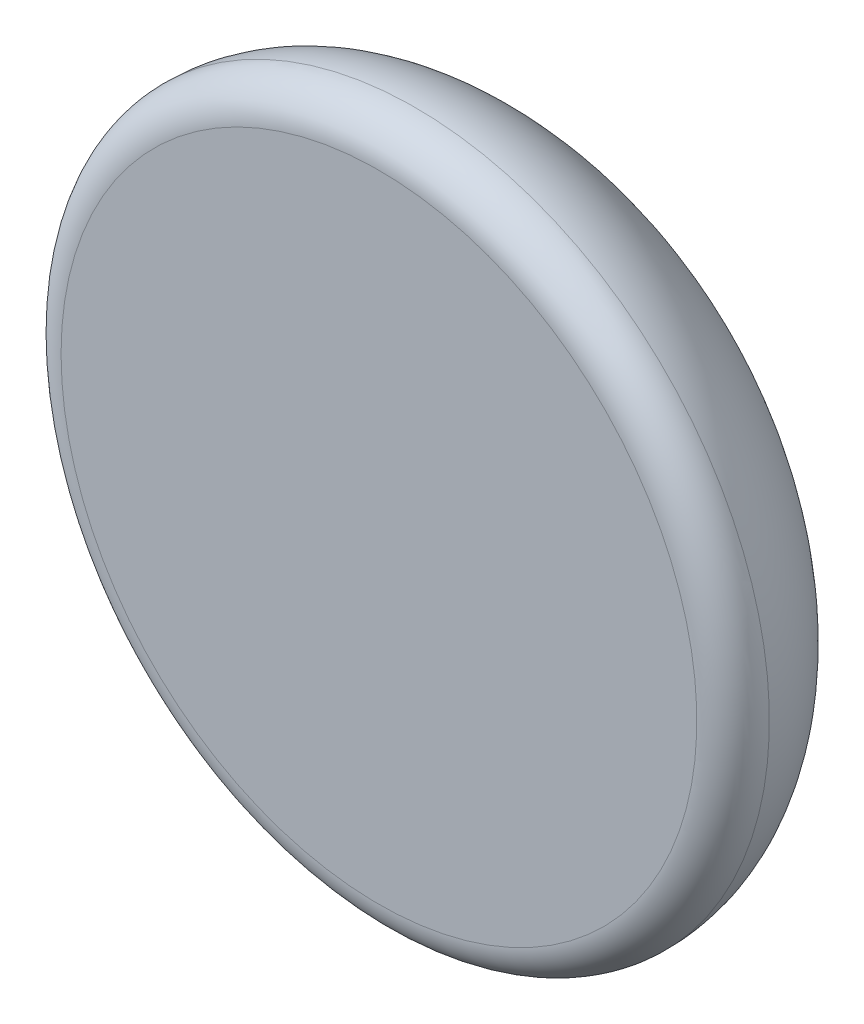
ISO-10303-21;
HEADER;
FILE_DESCRIPTION(('STEP AP214'),'2;1');
FILE_NAME('part.step','',(''),(''),'','','');
FILE_SCHEMA(('AUTOMOTIVE_DESIGN { 1 0 10303 214 1 1 1 1 }'));
ENDSEC;
DATA;
#1=APPLICATION_CONTEXT('core data for automotive mechanical design processes');
#2=APPLICATION_PROTOCOL_DEFINITION('international standard','automotive_design',2000,#1);
#3=PRODUCT_CONTEXT('',#1,'mechanical');
#4=PRODUCT('Part','Part','',(#3));
#5=PRODUCT_RELATED_PRODUCT_CATEGORY('part','',(#4));
#6=PRODUCT_DEFINITION_FORMATION('','',#4);
#7=PRODUCT_DEFINITION_CONTEXT('part definition',#1,'design');
#8=PRODUCT_DEFINITION('design','',#6,#7);
#9=PRODUCT_DEFINITION_SHAPE('','',#8);
#10=(LENGTH_UNIT() NAMED_UNIT(*) SI_UNIT(.MILLI.,.METRE.));
#11=(NAMED_UNIT(*) PLANE_ANGLE_UNIT() SI_UNIT($,.RADIAN.));
#12=(NAMED_UNIT(*) SI_UNIT($,.STERADIAN.) SOLID_ANGLE_UNIT());
#13=UNCERTAINTY_MEASURE_WITH_UNIT(LENGTH_MEASURE(1.E-05),#10,'distance_accuracy_value','');
#14=(GEOMETRIC_REPRESENTATION_CONTEXT(3) GLOBAL_UNCERTAINTY_ASSIGNED_CONTEXT((#13)) GLOBAL_UNIT_ASSIGNED_CONTEXT((#10,
#11,#12)) REPRESENTATION_CONTEXT('',''));
#15=CARTESIAN_POINT('',(0.,0.,0.));
#16=DIRECTION('',(0.,0.,1.));
#17=DIRECTION('',(1.,0.,0.));
#18=AXIS2_PLACEMENT_3D('',#15,#16,#17);
#19=CARTESIAN_POINT('',(0.,0.,0.));
#20=DIRECTION('',(0.,1.,0.));
#21=DIRECTION('',(-1.,0.,0.));
#22=AXIS2_PLACEMENT_3D('',#19,#20,#21);
#23=ELLIPSE('',#22,62.,33.65);
#24=TRIMMED_CURVE('',#23,(PARAMETER_VALUE(4.71238898038469)),
(PARAMETER_VALUE(7.85398163397448)),.T.,.PARAMETER.);
#25=CARTESIAN_POINT('',(0.,0.,-33.65));
#26=DIRECTION('',(0.,0.,-1.));
#27=AXIS1_PLACEMENT('',#25,#26);
#28=SURFACE_OF_REVOLUTION('',#24,#27);
#29=CARTESIAN_POINT('',(0.,0.,0.));
#30=DIRECTION('',(0.,0.,-1.));
#31=DIRECTION('',(-1.,0.,0.));
#32=AXIS2_PLACEMENT_3D('',#29,#30,#31);
#33=CIRCLE('',#32,62.);
#34=CARTESIAN_POINT('',(-62.,0.,0.));
#35=VERTEX_POINT('',#34);
#36=EDGE_CURVE('E11',#35,#35,#33,.T.);
#37=ORIENTED_EDGE('',*,*,#36,.T.);
#38=EDGE_LOOP('',(#37));
#39=FACE_BOUND('',#38,.T.);
#40=CARTESIAN_POINT('',(0.,0.,-33.65));
#41=VERTEX_POINT('',#40);
#42=VERTEX_LOOP('',#41);
#43=FACE_BOUND('',#42,.T.);
#44=ADVANCED_FACE('F33',(#39,#43),#28,.F.);
#45=CARTESIAN_POINT('',(0.,0.,0.));
#46=DIRECTION('',(0.,0.,-1.));
#47=DIRECTION('',(-1.,0.,0.));
#48=AXIS2_PLACEMENT_3D('',#45,#46,#47);
#49=TOROIDAL_SURFACE('',#48,55.65,6.35);
#50=CARTESIAN_POINT('',(0.,0.,6.35000000000001));
#51=DIRECTION('',(0.,0.,-1.));
#52=DIRECTION('',(-1.,0.,0.));
#53=AXIS2_PLACEMENT_3D('',#50,#51,#52);
#54=CIRCLE('',#53,55.65);
#55=CARTESIAN_POINT('',(-55.65,0.,6.35000000000001));
#56=VERTEX_POINT('',#55);
#57=EDGE_CURVE('E40',#56,#56,#54,.T.);
#58=ORIENTED_EDGE('',*,*,#57,.T.);
#59=EDGE_LOOP('',(#58));
#60=FACE_BOUND('',#59,.T.);
#61=ORIENTED_EDGE('',*,*,#36,.F.);
#62=EDGE_LOOP('',(#61));
#63=FACE_BOUND('',#62,.T.);
#64=ADVANCED_FACE('F44',(#60,#63),#49,.T.);
#65=CARTESIAN_POINT('',(-55.65,0.,6.35));
#66=DIRECTION('',(0.,0.,1.));
#67=DIRECTION('',(1.,0.,0.));
#68=AXIS2_PLACEMENT_3D('',#65,#66,#67);
#69=PLANE('',#68);
#70=ORIENTED_EDGE('',*,*,#57,.F.);
#71=EDGE_LOOP('',(#70));
#72=FACE_BOUND('',#71,.T.);
#73=ADVANCED_FACE('F49',(#72),#69,.T.);
#74=CLOSED_SHELL('',(#44,#64,#73));
#75=MANIFOLD_SOLID_BREP('B2',#74);
#76=ADVANCED_BREP_SHAPE_REPRESENTATION('',(#18,#75),#14);
#77=SHAPE_DEFINITION_REPRESENTATION(#9,#76);
ENDSEC;
END-ISO-10303-21;
